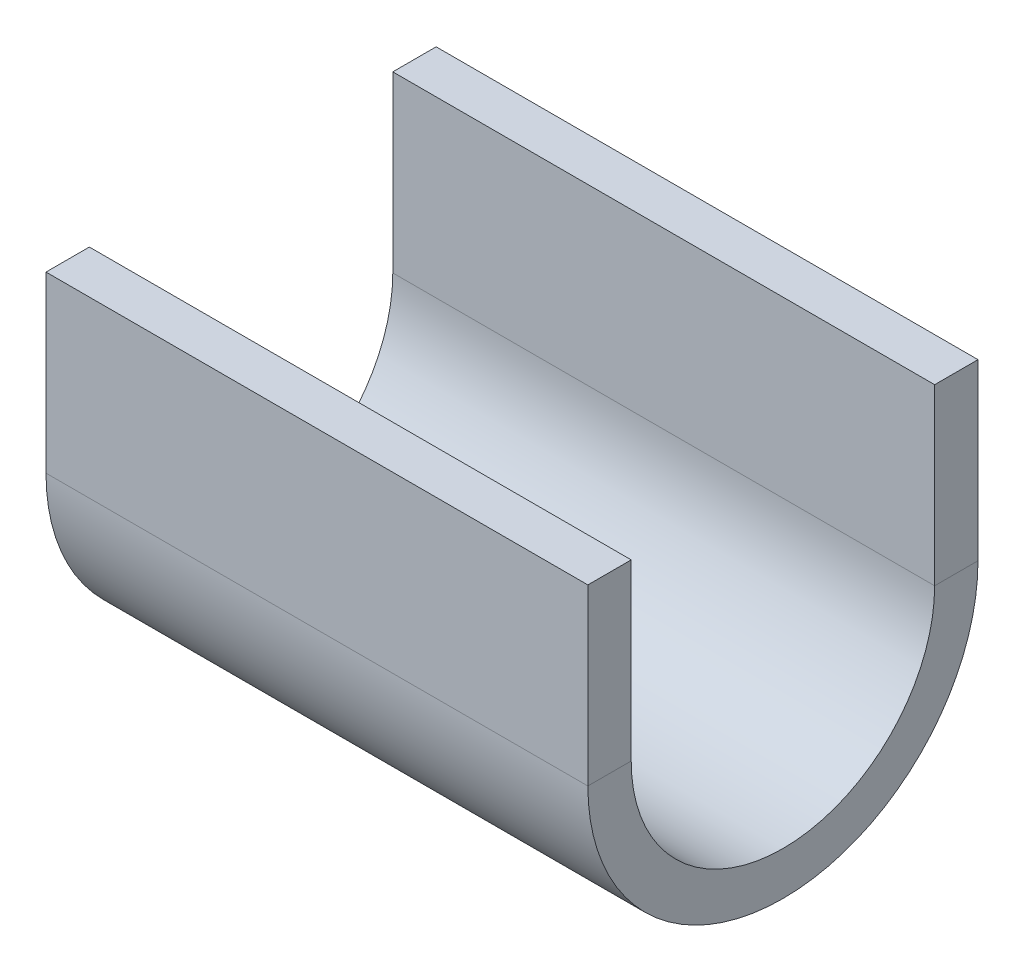
ISO-10303-21;
HEADER;
FILE_DESCRIPTION(('STEP AP214'),'2;1');
FILE_NAME('part.step','',(''),(''),'','','');
FILE_SCHEMA(('AUTOMOTIVE_DESIGN { 1 0 10303 214 1 1 1 1 }'));
ENDSEC;
DATA;
#1=APPLICATION_CONTEXT('core data for automotive mechanical design processes');
#2=APPLICATION_PROTOCOL_DEFINITION('international standard','automotive_design',2000,#1);
#3=PRODUCT_CONTEXT('',#1,'mechanical');
#4=PRODUCT('Part','Part','',(#3));
#5=PRODUCT_RELATED_PRODUCT_CATEGORY('part','',(#4));
#6=PRODUCT_DEFINITION_FORMATION('','',#4);
#7=PRODUCT_DEFINITION_CONTEXT('part definition',#1,'design');
#8=PRODUCT_DEFINITION('design','',#6,#7);
#9=PRODUCT_DEFINITION_SHAPE('','',#8);
#10=(LENGTH_UNIT() NAMED_UNIT(*) SI_UNIT(.MILLI.,.METRE.));
#11=(NAMED_UNIT(*) PLANE_ANGLE_UNIT() SI_UNIT($,.RADIAN.));
#12=(NAMED_UNIT(*) SI_UNIT($,.STERADIAN.) SOLID_ANGLE_UNIT());
#13=UNCERTAINTY_MEASURE_WITH_UNIT(LENGTH_MEASURE(1.E-05),#10,'distance_accuracy_value','');
#14=(GEOMETRIC_REPRESENTATION_CONTEXT(3) GLOBAL_UNCERTAINTY_ASSIGNED_CONTEXT((#13)) GLOBAL_UNIT_ASSIGNED_CONTEXT((#10,
#11,#12)) REPRESENTATION_CONTEXT('',''));
#15=CARTESIAN_POINT('',(0.,0.,0.));
#16=DIRECTION('',(0.,0.,1.));
#17=DIRECTION('',(1.,0.,0.));
#18=AXIS2_PLACEMENT_3D('',#15,#16,#17);
#19=CARTESIAN_POINT('',(25.,6.96487005248575,-7.70041784099718));
#20=DIRECTION('',(1.,0.,0.));
#21=DIRECTION('',(0.,0.,-1.));
#22=AXIS2_PLACEMENT_3D('',#19,#20,#21);
#23=PLANE('',#22);
#24=DIRECTION('',(0.,0.,-1.));
#25=VECTOR('',#24,1.);
#26=CARTESIAN_POINT('',(25.,6.96487005248575,-7.70041784099718));
#27=LINE('',#26,#25);
#28=CARTESIAN_POINT('',(25.,6.96487005248575,-7.70041784099718));
#29=VERTEX_POINT('',#28);
#30=CARTESIAN_POINT('',(25.,6.96487005248575,-9.70041784099718));
#31=VERTEX_POINT('',#30);
#32=EDGE_CURVE('E11',#29,#31,#27,.T.);
#33=ORIENTED_EDGE('',*,*,#32,.F.);
#34=CARTESIAN_POINT('',(25.,6.96487005248575,-0.700417840997177));
#35=DIRECTION('',(-1.,0.,0.));
#36=DIRECTION('',(0.,0.,-1.));
#37=AXIS2_PLACEMENT_3D('',#34,#35,#36);
#38=CIRCLE('',#37,7.);
#39=CARTESIAN_POINT('',(25.,6.96487005248575,6.29958215900282));
#40=VERTEX_POINT('',#39);
#41=EDGE_CURVE('E127',#29,#40,#38,.T.);
#42=ORIENTED_EDGE('',*,*,#41,.T.);
#43=DIRECTION('',(0.,0.,-1.));
#44=VECTOR('',#43,1.);
#45=CARTESIAN_POINT('',(25.,6.96487005248575,8.29958215900282));
#46=LINE('',#45,#44);
#47=CARTESIAN_POINT('',(25.,6.96487005248575,8.29958215900282));
#48=VERTEX_POINT('',#47);
#49=EDGE_CURVE('E45',#48,#40,#46,.T.);
#50=ORIENTED_EDGE('',*,*,#49,.F.);
#51=CARTESIAN_POINT('',(25.,6.96487005248575,-0.700417840997177));
#52=DIRECTION('',(1.,0.,0.));
#53=DIRECTION('',(0.,0.,-1.));
#54=AXIS2_PLACEMENT_3D('',#51,#52,#53);
#55=CIRCLE('',#54,9.);
#56=EDGE_CURVE('E134',#31,#48,#55,.F.);
#57=ORIENTED_EDGE('',*,*,#56,.F.);
#58=EDGE_LOOP('',(#33,#42,#50,#57));
#59=FACE_BOUND('',#58,.T.);
#60=ADVANCED_FACE('F37',(#59),#23,.T.);
#61=CARTESIAN_POINT('',(25.,6.96487005248575,8.29958215900282));
#62=DIRECTION('',(1.,0.,0.));
#63=DIRECTION('',(0.,0.,-1.));
#64=AXIS2_PLACEMENT_3D('',#61,#62,#63);
#65=PLANE('',#64);
#66=DIRECTION('',(0.,-1.,0.));
#67=VECTOR('',#66,1.);
#68=CARTESIAN_POINT('',(25.,6.96487005248575,-7.70041784099718));
#69=LINE('',#68,#67);
#70=CARTESIAN_POINT('',(25.,15.,-7.70041784099718));
#71=VERTEX_POINT('',#70);
#72=EDGE_CURVE('E122',#71,#29,#69,.T.);
#73=ORIENTED_EDGE('',*,*,#72,.T.);
#74=ORIENTED_EDGE('',*,*,#32,.T.);
#75=DIRECTION('',(0.,1.,0.));
#76=VECTOR('',#75,1.);
#77=CARTESIAN_POINT('',(25.,6.96487005248575,-9.70041784099718));
#78=LINE('',#77,#76);
#79=CARTESIAN_POINT('',(25.,15.,-9.70041784099718));
#80=VERTEX_POINT('',#79);
#81=EDGE_CURVE('E132',#80,#31,#78,.F.);
#82=ORIENTED_EDGE('',*,*,#81,.F.);
#83=DIRECTION('',(0.,0.,-1.));
#84=VECTOR('',#83,1.);
#85=CARTESIAN_POINT('',(25.,15.,-7.70041784099718));
#86=LINE('',#85,#84);
#87=EDGE_CURVE('E112',#71,#80,#86,.T.);
#88=ORIENTED_EDGE('',*,*,#87,.F.);
#89=EDGE_LOOP('',(#73,#74,#82,#88));
#90=FACE_BOUND('',#89,.T.);
#91=ADVANCED_FACE('F130',(#90),#65,.T.);
#92=CARTESIAN_POINT('',(0.,6.96487005248575,6.29958215900282));
#93=DIRECTION('',(-1.,0.,0.));
#94=DIRECTION('',(0.,0.,1.));
#95=AXIS2_PLACEMENT_3D('',#92,#93,#94);
#96=PLANE('',#95);
#97=DIRECTION('',(0.,0.,1.));
#98=VECTOR('',#97,1.);
#99=CARTESIAN_POINT('',(0.,6.96487005248575,6.29958215900282));
#100=LINE('',#99,#98);
#101=CARTESIAN_POINT('',(0.,6.96487005248575,6.29958215900282));
#102=VERTEX_POINT('',#101);
#103=CARTESIAN_POINT('',(0.,6.96487005248575,8.29958215900282));
#104=VERTEX_POINT('',#103);
#105=EDGE_CURVE('E87',#102,#104,#100,.T.);
#106=ORIENTED_EDGE('',*,*,#105,.F.);
#107=CARTESIAN_POINT('',(0.,6.96487005248575,-0.700417840997177));
#108=DIRECTION('',(-1.,0.,0.));
#109=DIRECTION('',(0.,0.,1.));
#110=AXIS2_PLACEMENT_3D('',#107,#108,#109);
#111=CIRCLE('',#110,7.);
#112=CARTESIAN_POINT('',(0.,6.96487005248575,-7.70041784099718));
#113=VERTEX_POINT('',#112);
#114=EDGE_CURVE('E156',#113,#102,#111,.T.);
#115=ORIENTED_EDGE('',*,*,#114,.F.);
#116=DIRECTION('',(0.,0.,1.));
#117=VECTOR('',#116,1.);
#118=CARTESIAN_POINT('',(0.,6.96487005248575,-9.70041784099718));
#119=LINE('',#118,#117);
#120=CARTESIAN_POINT('',(0.,6.96487005248575,-9.70041784099718));
#121=VERTEX_POINT('',#120);
#122=EDGE_CURVE('E81',#121,#113,#119,.T.);
#123=ORIENTED_EDGE('',*,*,#122,.F.);
#124=CARTESIAN_POINT('',(0.,6.96487005248575,-0.700417840997177));
#125=DIRECTION('',(1.,0.,0.));
#126=DIRECTION('',(0.,0.,-1.));
#127=AXIS2_PLACEMENT_3D('',#124,#125,#126);
#128=CIRCLE('',#127,9.);
#129=EDGE_CURVE('E149',#121,#104,#128,.F.);
#130=ORIENTED_EDGE('',*,*,#129,.T.);
#131=EDGE_LOOP('',(#106,#115,#123,#130));
#132=FACE_BOUND('',#131,.T.);
#133=ADVANCED_FACE('F178',(#132),#96,.T.);
#134=CARTESIAN_POINT('',(0.,6.96487005248575,-9.70041784099718));
#135=DIRECTION('',(-1.,0.,0.));
#136=DIRECTION('',(0.,0.,1.));
#137=AXIS2_PLACEMENT_3D('',#134,#135,#136);
#138=PLANE('',#137);
#139=DIRECTION('',(0.,1.,0.));
#140=VECTOR('',#139,1.);
#141=CARTESIAN_POINT('',(0.,6.96487005248575,6.29958215900282));
#142=LINE('',#141,#140);
#143=CARTESIAN_POINT('',(0.,15.,6.29958215900282));
#144=VERTEX_POINT('',#143);
#145=EDGE_CURVE('E140',#102,#144,#142,.T.);
#146=ORIENTED_EDGE('',*,*,#145,.F.);
#147=ORIENTED_EDGE('',*,*,#105,.T.);
#148=DIRECTION('',(0.,1.,0.));
#149=VECTOR('',#148,1.);
#150=CARTESIAN_POINT('',(0.,6.96487005248575,8.29958215900282));
#151=LINE('',#150,#149);
#152=CARTESIAN_POINT('',(0.,15.,8.29958215900282));
#153=VERTEX_POINT('',#152);
#154=EDGE_CURVE('E146',#104,#153,#151,.T.);
#155=ORIENTED_EDGE('',*,*,#154,.T.);
#156=DIRECTION('',(0.,0.,-1.));
#157=VECTOR('',#156,1.);
#158=CARTESIAN_POINT('',(0.,15.,8.29958215900282));
#159=LINE('',#158,#157);
#160=EDGE_CURVE('E143',#153,#144,#159,.T.);
#161=ORIENTED_EDGE('',*,*,#160,.T.);
#162=EDGE_LOOP('',(#146,#147,#155,#161));
#163=FACE_BOUND('',#162,.T.);
#164=ADVANCED_FACE('F175',(#163),#138,.T.);
#165=CARTESIAN_POINT('',(25.,6.96487005248575,6.29958215900282));
#166=DIRECTION('',(0.,0.,1.));
#167=DIRECTION('',(0.,-1.,0.));
#168=AXIS2_PLACEMENT_3D('',#165,#166,#167);
#169=PLANE('',#168);
#170=ORIENTED_EDGE('',*,*,#145,.T.);
#171=DIRECTION('',(-1.,0.,0.));
#172=VECTOR('',#171,1.);
#173=CARTESIAN_POINT('',(25.,15.,6.29958215900282));
#174=LINE('',#173,#172);
#175=CARTESIAN_POINT('',(25.,15.,6.29958215900282));
#176=VERTEX_POINT('',#175);
#177=EDGE_CURVE('E170',#176,#144,#174,.T.);
#178=ORIENTED_EDGE('',*,*,#177,.F.);
#179=DIRECTION('',(0.,1.,0.));
#180=VECTOR('',#179,1.);
#181=CARTESIAN_POINT('',(25.,6.96487005248575,6.29958215900282));
#182=LINE('',#181,#180);
#183=EDGE_CURVE('E93',#40,#176,#182,.T.);
#184=ORIENTED_EDGE('',*,*,#183,.F.);
#185=DIRECTION('',(-1.,0.,0.));
#186=VECTOR('',#185,1.);
#187=CARTESIAN_POINT('',(25.,6.96487005248575,6.29958215900282));
#188=LINE('',#187,#186);
#189=EDGE_CURVE('E139',#40,#102,#188,.T.);
#190=ORIENTED_EDGE('',*,*,#189,.T.);
#191=EDGE_LOOP('',(#170,#178,#184,#190));
#192=FACE_BOUND('',#191,.T.);
#193=ADVANCED_FACE('F195',(#192),#169,.F.);
#194=CARTESIAN_POINT('',(25.,15.,8.29958215900282));
#195=DIRECTION('',(0.,1.,0.));
#196=DIRECTION('',(0.,0.,1.));
#197=AXIS2_PLACEMENT_3D('',#194,#195,#196);
#198=PLANE('',#197);
#199=ORIENTED_EDGE('',*,*,#160,.F.);
#200=DIRECTION('',(-1.,0.,0.));
#201=VECTOR('',#200,1.);
#202=CARTESIAN_POINT('',(25.,15.,8.29958215900282));
#203=LINE('',#202,#201);
#204=CARTESIAN_POINT('',(25.,15.,8.29958215900282));
#205=VERTEX_POINT('',#204);
#206=EDGE_CURVE('E168',#205,#153,#203,.T.);
#207=ORIENTED_EDGE('',*,*,#206,.F.);
#208=DIRECTION('',(0.,0.,-1.));
#209=VECTOR('',#208,1.);
#210=CARTESIAN_POINT('',(25.,15.,8.29958215900282));
#211=LINE('',#210,#209);
#212=EDGE_CURVE('E193',#205,#176,#211,.T.);
#213=ORIENTED_EDGE('',*,*,#212,.T.);
#214=ORIENTED_EDGE('',*,*,#177,.T.);
#215=EDGE_LOOP('',(#199,#207,#213,#214));
#216=FACE_BOUND('',#215,.T.);
#217=ADVANCED_FACE('F192',(#216),#198,.T.);
#218=CARTESIAN_POINT('',(25.,6.96487005248575,8.29958215900282));
#219=DIRECTION('',(0.,0.,1.));
#220=DIRECTION('',(0.,-1.,0.));
#221=AXIS2_PLACEMENT_3D('',#218,#219,#220);
#222=PLANE('',#221);
#223=ORIENTED_EDGE('',*,*,#154,.F.);
#224=DIRECTION('',(-1.,0.,0.));
#225=VECTOR('',#224,1.);
#226=CARTESIAN_POINT('',(25.,6.96487005248575,8.29958215900282));
#227=LINE('',#226,#225);
#228=EDGE_CURVE('E165',#48,#104,#227,.T.);
#229=ORIENTED_EDGE('',*,*,#228,.F.);
#230=DIRECTION('',(0.,1.,0.));
#231=VECTOR('',#230,1.);
#232=CARTESIAN_POINT('',(25.,6.96487005248575,8.29958215900282));
#233=LINE('',#232,#231);
#234=EDGE_CURVE('E189',#48,#205,#233,.T.);
#235=ORIENTED_EDGE('',*,*,#234,.T.);
#236=ORIENTED_EDGE('',*,*,#206,.T.);
#237=EDGE_LOOP('',(#223,#229,#235,#236));
#238=FACE_BOUND('',#237,.T.);
#239=ADVANCED_FACE('F187',(#238),#222,.T.);
#240=CARTESIAN_POINT('',(25.,6.96487005248575,-0.700417840997177));
#241=DIRECTION('',(-1.,0.,0.));
#242=DIRECTION('',(0.,0.,1.));
#243=AXIS2_PLACEMENT_3D('',#240,#241,#242);
#244=CYLINDRICAL_SURFACE('',#243,9.);
#245=ORIENTED_EDGE('',*,*,#129,.F.);
#246=DIRECTION('',(-1.,0.,0.));
#247=VECTOR('',#246,1.);
#248=CARTESIAN_POINT('',(25.,6.96487005248575,-9.70041784099718));
#249=LINE('',#248,#247);
#250=EDGE_CURVE('E162',#31,#121,#249,.T.);
#251=ORIENTED_EDGE('',*,*,#250,.F.);
#252=ORIENTED_EDGE('',*,*,#56,.T.);
#253=ORIENTED_EDGE('',*,*,#228,.T.);
#254=EDGE_LOOP('',(#245,#251,#252,#253));
#255=FACE_BOUND('',#254,.T.);
#256=ADVANCED_FACE('F183',(#255),#244,.T.);
#257=CARTESIAN_POINT('',(25.,6.96487005248575,-9.70041784099718));
#258=DIRECTION('',(0.,0.,-1.));
#259=DIRECTION('',(-1.,0.,0.));
#260=AXIS2_PLACEMENT_3D('',#257,#258,#259);
#261=PLANE('',#260);
#262=DIRECTION('',(0.,1.,0.));
#263=VECTOR('',#262,1.);
#264=CARTESIAN_POINT('',(0.,6.96487005248575,-9.70041784099718));
#265=LINE('',#264,#263);
#266=CARTESIAN_POINT('',(0.,15.,-9.70041784099718));
#267=VERTEX_POINT('',#266);
#268=EDGE_CURVE('E151',#267,#121,#265,.F.);
#269=ORIENTED_EDGE('',*,*,#268,.F.);
#270=DIRECTION('',(-1.,0.,0.));
#271=VECTOR('',#270,1.);
#272=CARTESIAN_POINT('',(25.,15.,-9.70041784099718));
#273=LINE('',#272,#271);
#274=EDGE_CURVE('E117',#80,#267,#273,.T.);
#275=ORIENTED_EDGE('',*,*,#274,.F.);
#276=ORIENTED_EDGE('',*,*,#81,.T.);
#277=ORIENTED_EDGE('',*,*,#250,.T.);
#278=EDGE_LOOP('',(#269,#275,#276,#277));
#279=FACE_BOUND('',#278,.T.);
#280=ADVANCED_FACE('F202',(#279),#261,.T.);
#281=CARTESIAN_POINT('',(25.,15.,-7.70041784099718));
#282=DIRECTION('',(0.,1.,0.));
#283=DIRECTION('',(0.,0.,1.));
#284=AXIS2_PLACEMENT_3D('',#281,#282,#283);
#285=PLANE('',#284);
#286=DIRECTION('',(0.,0.,-1.));
#287=VECTOR('',#286,1.);
#288=CARTESIAN_POINT('',(0.,15.,-7.70041784099718));
#289=LINE('',#288,#287);
#290=CARTESIAN_POINT('',(0.,15.,-7.70041784099718));
#291=VERTEX_POINT('',#290);
#292=EDGE_CURVE('E114',#291,#267,#289,.T.);
#293=ORIENTED_EDGE('',*,*,#292,.F.);
#294=DIRECTION('',(-1.,0.,0.));
#295=VECTOR('',#294,1.);
#296=CARTESIAN_POINT('',(25.,15.,-7.70041784099718));
#297=LINE('',#296,#295);
#298=EDGE_CURVE('E108',#71,#291,#297,.T.);
#299=ORIENTED_EDGE('',*,*,#298,.F.);
#300=ORIENTED_EDGE('',*,*,#87,.T.);
#301=ORIENTED_EDGE('',*,*,#274,.T.);
#302=EDGE_LOOP('',(#293,#299,#300,#301));
#303=FACE_BOUND('',#302,.T.);
#304=ADVANCED_FACE('F110',(#303),#285,.T.);
#305=CARTESIAN_POINT('',(25.,6.96487005248575,-7.70041784099718));
#306=DIRECTION('',(0.,0.,-1.));
#307=DIRECTION('',(-1.,0.,0.));
#308=AXIS2_PLACEMENT_3D('',#305,#306,#307);
#309=PLANE('',#308);
#310=DIRECTION('',(0.,-1.,0.));
#311=VECTOR('',#310,1.);
#312=CARTESIAN_POINT('',(0.,6.96487005248575,-7.70041784099718));
#313=LINE('',#312,#311);
#314=EDGE_CURVE('E154',#291,#113,#313,.T.);
#315=ORIENTED_EDGE('',*,*,#314,.T.);
#316=DIRECTION('',(-1.,0.,0.));
#317=VECTOR('',#316,1.);
#318=CARTESIAN_POINT('',(25.,6.96487005248575,-7.70041784099718));
#319=LINE('',#318,#317);
#320=EDGE_CURVE('E118',#29,#113,#319,.T.);
#321=ORIENTED_EDGE('',*,*,#320,.F.);
#322=ORIENTED_EDGE('',*,*,#72,.F.);
#323=ORIENTED_EDGE('',*,*,#298,.T.);
#324=EDGE_LOOP('',(#315,#321,#322,#323));
#325=FACE_BOUND('',#324,.T.);
#326=ADVANCED_FACE('F123',(#325),#309,.F.);
#327=CARTESIAN_POINT('',(25.,6.96487005248575,-0.700417840997177));
#328=DIRECTION('',(-1.,0.,0.));
#329=DIRECTION('',(0.,0.,1.));
#330=AXIS2_PLACEMENT_3D('',#327,#328,#329);
#331=CYLINDRICAL_SURFACE('',#330,7.);
#332=ORIENTED_EDGE('',*,*,#114,.T.);
#333=ORIENTED_EDGE('',*,*,#189,.F.);
#334=ORIENTED_EDGE('',*,*,#41,.F.);
#335=ORIENTED_EDGE('',*,*,#320,.T.);
#336=EDGE_LOOP('',(#332,#333,#334,#335));
#337=FACE_BOUND('',#336,.T.);
#338=ADVANCED_FACE('F198',(#337),#331,.F.);
#339=CARTESIAN_POINT('',(25.,6.96487005248575,-0.700417840997177));
#340=DIRECTION('',(1.,0.,0.));
#341=DIRECTION('',(0.,0.,-1.));
#342=AXIS2_PLACEMENT_3D('',#339,#340,#341);
#343=PLANE('',#342);
#344=ORIENTED_EDGE('',*,*,#183,.T.);
#345=ORIENTED_EDGE('',*,*,#212,.F.);
#346=ORIENTED_EDGE('',*,*,#234,.F.);
#347=ORIENTED_EDGE('',*,*,#49,.T.);
#348=EDGE_LOOP('',(#344,#345,#346,#347));
#349=FACE_BOUND('',#348,.T.);
#350=ADVANCED_FACE('F271',(#349),#343,.T.);
#351=CARTESIAN_POINT('',(0.,6.96487005248575,-0.700417840997177));
#352=DIRECTION('',(1.,0.,0.));
#353=DIRECTION('',(0.,0.,-1.));
#354=AXIS2_PLACEMENT_3D('',#351,#352,#353);
#355=PLANE('',#354);
#356=ORIENTED_EDGE('',*,*,#268,.T.);
#357=ORIENTED_EDGE('',*,*,#122,.T.);
#358=ORIENTED_EDGE('',*,*,#314,.F.);
#359=ORIENTED_EDGE('',*,*,#292,.T.);
#360=EDGE_LOOP('',(#356,#357,#358,#359));
#361=FACE_BOUND('',#360,.T.);
#362=ADVANCED_FACE('F199',(#361),#355,.F.);
#363=CLOSED_SHELL('',(#60,#91,#133,#164,#193,#217,#239,#256,#280,#304,#326,#338,#350,#362));
#364=MANIFOLD_SOLID_BREP('B2',#363);
#365=ADVANCED_BREP_SHAPE_REPRESENTATION('',(#18,#364),#14);
#366=SHAPE_DEFINITION_REPRESENTATION(#9,#365);
ENDSEC;
END-ISO-10303-21;
